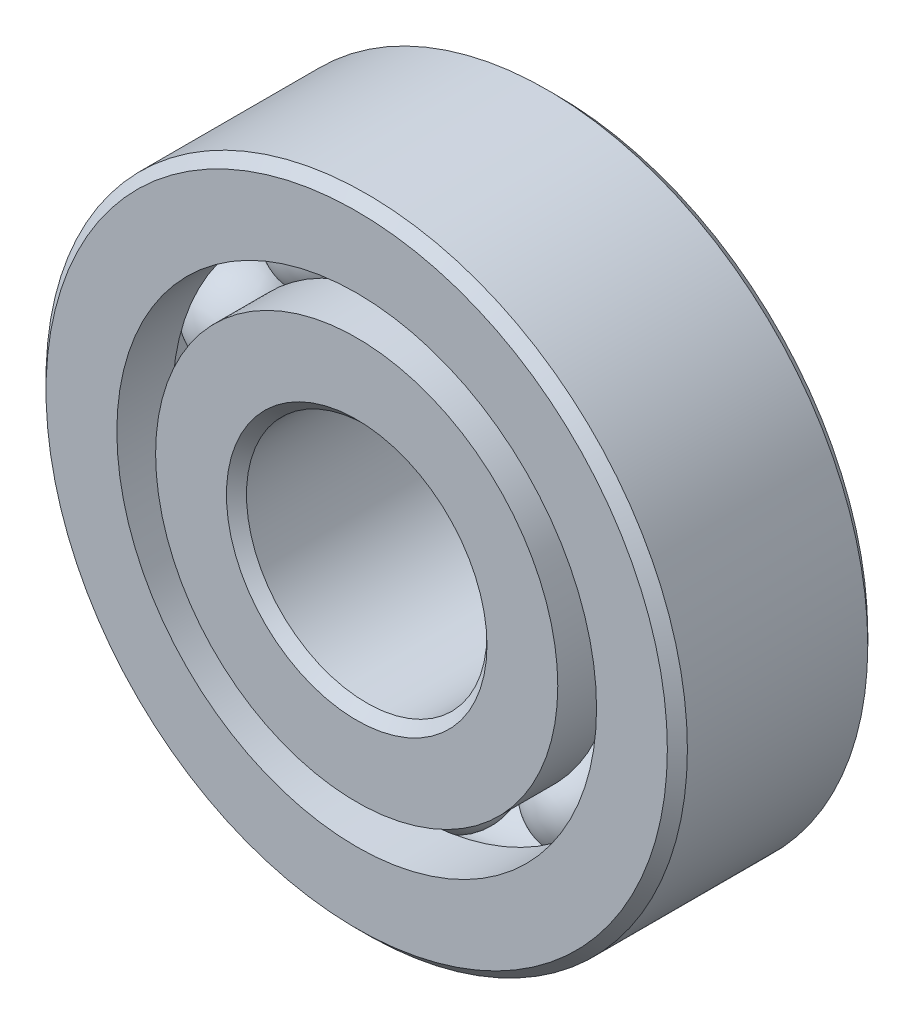
ISO-10303-21;
HEADER;
FILE_DESCRIPTION(('STEP AP214'),'2;1');
FILE_NAME('part.step','',(''),(''),'','','');
FILE_SCHEMA(('AUTOMOTIVE_DESIGN { 1 0 10303 214 1 1 1 1 }'));
ENDSEC;
DATA;
#1=APPLICATION_CONTEXT('core data for automotive mechanical design processes');
#2=APPLICATION_PROTOCOL_DEFINITION('international standard','automotive_design',2000,#1);
#3=PRODUCT_CONTEXT('',#1,'mechanical');
#4=PRODUCT('Part','Part','',(#3));
#5=PRODUCT_RELATED_PRODUCT_CATEGORY('part','',(#4));
#6=PRODUCT_DEFINITION_FORMATION('','',#4);
#7=PRODUCT_DEFINITION_CONTEXT('part definition',#1,'design');
#8=PRODUCT_DEFINITION('design','',#6,#7);
#9=PRODUCT_DEFINITION_SHAPE('','',#8);
#10=(LENGTH_UNIT() NAMED_UNIT(*) SI_UNIT(.MILLI.,.METRE.));
#11=(NAMED_UNIT(*) PLANE_ANGLE_UNIT() SI_UNIT($,.RADIAN.));
#12=(NAMED_UNIT(*) SI_UNIT($,.STERADIAN.) SOLID_ANGLE_UNIT());
#13=UNCERTAINTY_MEASURE_WITH_UNIT(LENGTH_MEASURE(1.E-05),#10,'distance_accuracy_value','');
#14=(GEOMETRIC_REPRESENTATION_CONTEXT(3) GLOBAL_UNCERTAINTY_ASSIGNED_CONTEXT((#13)) GLOBAL_UNIT_ASSIGNED_CONTEXT((#10,
#11,#12)) REPRESENTATION_CONTEXT('',''));
#15=CARTESIAN_POINT('',(0.,0.,0.));
#16=DIRECTION('',(0.,0.,1.));
#17=DIRECTION('',(1.,0.,0.));
#18=AXIS2_PLACEMENT_3D('',#15,#16,#17);
#19=CARTESIAN_POINT('',(-2.56604999203928,3.53186481606816,0.));
#20=DIRECTION('',(0.,0.,1.));
#21=DIRECTION('',(-0.587785252292462,0.809016994374955,0.));
#22=AXIS2_PLACEMENT_3D('',#19,#20,#21);
#23=SPHERICAL_SURFACE('',#22,0.961832467237323);
#24=CARTESIAN_POINT('',(-2.56604999203928,3.53186481606816,0.961832467237323));
#25=VERTEX_POINT('',#24);
#26=VERTEX_LOOP('',#25);
#27=FACE_BOUND('',#26,.T.);
#28=ADVANCED_FACE('F39',(#27),#23,.T.);
#29=CLOSED_SHELL('',(#28));
#30=MANIFOLD_SOLID_BREP('B2',#29);
#31=CARTESIAN_POINT('',(-4.15195610395101,1.34905231606818,0.));
#32=DIRECTION('',(0.,0.,1.));
#33=DIRECTION('',(-0.95105651629515,0.309016994374958,0.));
#34=AXIS2_PLACEMENT_3D('',#31,#32,#33);
#35=SPHERICAL_SURFACE('',#34,0.961832467237323);
#36=CARTESIAN_POINT('',(-4.15195610395101,1.34905231606818,0.961832467237323));
#37=VERTEX_POINT('',#36);
#38=VERTEX_LOOP('',#37);
#39=FACE_BOUND('',#38,.T.);
#40=ADVANCED_FACE('F59',(#39),#35,.T.);
#41=CLOSED_SHELL('',(#40));
#42=MANIFOLD_SOLID_BREP('B6',#41);
#43=CARTESIAN_POINT('',(-4.15195610395104,-1.34905231606809,0.));
#44=DIRECTION('',(0.,0.,1.));
#45=DIRECTION('',(-0.951056516295157,-0.309016994374938,0.));
#46=AXIS2_PLACEMENT_3D('',#43,#44,#45);
#47=SPHERICAL_SURFACE('',#46,0.961832467237323);
#48=CARTESIAN_POINT('',(-4.15195610395104,-1.34905231606809,0.961832467237323));
#49=VERTEX_POINT('',#48);
#50=VERTEX_LOOP('',#49);
#51=FACE_BOUND('',#50,.T.);
#52=ADVANCED_FACE('F79',(#51),#47,.T.);
#53=CLOSED_SHELL('',(#52));
#54=MANIFOLD_SOLID_BREP('B35',#53);
#55=CARTESIAN_POINT('',(-2.56604999203936,-3.53186481606811,0.));
#56=DIRECTION('',(0.,0.,1.));
#57=DIRECTION('',(-0.58778525229248,-0.809016994374942,0.));
#58=AXIS2_PLACEMENT_3D('',#55,#56,#57);
#59=SPHERICAL_SURFACE('',#58,0.961832467237323);
#60=CARTESIAN_POINT('',(-2.56604999203936,-3.53186481606811,0.961832467237323));
#61=VERTEX_POINT('',#60);
#62=VERTEX_LOOP('',#61);
#63=FACE_BOUND('',#62,.T.);
#64=ADVANCED_FACE('F99',(#63),#59,.T.);
#65=CLOSED_SHELL('',(#64));
#66=MANIFOLD_SOLID_BREP('B55',#65);
#67=CARTESIAN_POINT('',(0.,-4.365625,0.));
#68=DIRECTION('',(0.,0.,1.));
#69=DIRECTION('',(0.,-1.,0.));
#70=AXIS2_PLACEMENT_3D('',#67,#68,#69);
#71=SPHERICAL_SURFACE('',#70,0.961832467237323);
#72=CARTESIAN_POINT('',(0.,-4.365625,0.961832467237323));
#73=VERTEX_POINT('',#72);
#74=VERTEX_LOOP('',#73);
#75=FACE_BOUND('',#74,.T.);
#76=ADVANCED_FACE('F119',(#75),#71,.T.);
#77=CLOSED_SHELL('',(#76));
#78=MANIFOLD_SOLID_BREP('B75',#77);
#79=CARTESIAN_POINT('',(2.56604999203931,-3.53186481606814,0.));
#80=DIRECTION('',(0.,0.,1.));
#81=DIRECTION('',(0.587785252292469,-0.809016994374951,0.));
#82=AXIS2_PLACEMENT_3D('',#79,#80,#81);
#83=SPHERICAL_SURFACE('',#82,0.961832467237323);
#84=CARTESIAN_POINT('',(2.56604999203931,-3.53186481606814,0.961832467237323));
#85=VERTEX_POINT('',#84);
#86=VERTEX_LOOP('',#85);
#87=FACE_BOUND('',#86,.T.);
#88=ADVANCED_FACE('F139',(#87),#83,.T.);
#89=CLOSED_SHELL('',(#88));
#90=MANIFOLD_SOLID_BREP('B95',#89);
#91=CARTESIAN_POINT('',(4.15195610395102,-1.34905231606815,0.));
#92=DIRECTION('',(0.,0.,1.));
#93=DIRECTION('',(0.951056516295152,-0.309016994374952,0.));
#94=AXIS2_PLACEMENT_3D('',#91,#92,#93);
#95=SPHERICAL_SURFACE('',#94,0.961832467237323);
#96=CARTESIAN_POINT('',(4.15195610395102,-1.34905231606815,0.961832467237323));
#97=VERTEX_POINT('',#96);
#98=VERTEX_LOOP('',#97);
#99=FACE_BOUND('',#98,.T.);
#100=ADVANCED_FACE('F159',(#99),#95,.T.);
#101=CLOSED_SHELL('',(#100));
#102=MANIFOLD_SOLID_BREP('B115',#101);
#103=CARTESIAN_POINT('',(4.15195610395103,1.34905231606812,0.));
#104=DIRECTION('',(0.,0.,1.));
#105=DIRECTION('',(0.951056516295155,0.309016994374945,0.));
#106=AXIS2_PLACEMENT_3D('',#103,#104,#105);
#107=SPHERICAL_SURFACE('',#106,0.961832467237323);
#108=CARTESIAN_POINT('',(4.15195610395103,1.34905231606812,0.961832467237323));
#109=VERTEX_POINT('',#108);
#110=VERTEX_LOOP('',#109);
#111=FACE_BOUND('',#110,.T.);
#112=ADVANCED_FACE('F179',(#111),#107,.T.);
#113=CLOSED_SHELL('',(#112));
#114=MANIFOLD_SOLID_BREP('B135',#113);
#115=CARTESIAN_POINT('',(2.56604999203933,3.53186481606813,0.));
#116=DIRECTION('',(0.,0.,1.));
#117=DIRECTION('',(0.587785252292474,0.809016994374947,0.));
#118=AXIS2_PLACEMENT_3D('',#115,#116,#117);
#119=SPHERICAL_SURFACE('',#118,0.961832467237323);
#120=CARTESIAN_POINT('',(2.56604999203933,3.53186481606813,0.961832467237323));
#121=VERTEX_POINT('',#120);
#122=VERTEX_LOOP('',#121);
#123=FACE_BOUND('',#122,.T.);
#124=ADVANCED_FACE('F199',(#123),#119,.T.);
#125=CLOSED_SHELL('',(#124));
#126=MANIFOLD_SOLID_BREP('B155',#125);
#127=CARTESIAN_POINT('',(0.,4.365625,0.));
#128=DIRECTION('',(0.,0.,1.));
#129=DIRECTION('',(0.,1.,0.));
#130=AXIS2_PLACEMENT_3D('',#127,#128,#129);
#131=SPHERICAL_SURFACE('',#130,0.961832467237323);
#132=CARTESIAN_POINT('',(0.,4.365625,0.961832467237323));
#133=VERTEX_POINT('',#132);
#134=VERTEX_LOOP('',#133);
#135=FACE_BOUND('',#134,.T.);
#136=ADVANCED_FACE('F221',(#135),#131,.T.);
#137=CLOSED_SHELL('',(#136));
#138=MANIFOLD_SOLID_BREP('B175',#137);
#139=CARTESIAN_POINT('',(0.,3.98183379120879,1.984375));
#140=DIRECTION('',(0.,0.,-1.));
#141=DIRECTION('',(-1.,0.,0.));
#142=AXIS2_PLACEMENT_3D('',#139,#140,#141);
#143=PLANE('',#142);
#144=CARTESIAN_POINT('',(0.,0.,1.984375));
#145=DIRECTION('',(0.,0.,1.));
#146=DIRECTION('',(1.,0.,0.));
#147=AXIS2_PLACEMENT_3D('',#144,#145,#146);
#148=CIRCLE('',#147,2.5796875);
#149=CARTESIAN_POINT('',(2.5796875,0.,1.984375));
#150=VERTEX_POINT('',#149);
#151=EDGE_CURVE('E268',#150,#150,#148,.T.);
#152=ORIENTED_EDGE('',*,*,#151,.F.);
#153=EDGE_LOOP('',(#152));
#154=FACE_BOUND('',#153,.T.);
#155=CARTESIAN_POINT('',(0.,0.,1.984375));
#156=DIRECTION('',(0.,0.,1.));
#157=DIRECTION('',(1.,0.,0.));
#158=AXIS2_PLACEMENT_3D('',#155,#156,#157);
#159=CIRCLE('',#158,3.98183379120879);
#160=CARTESIAN_POINT('',(3.98183379120879,0.,1.984375));
#161=VERTEX_POINT('',#160);
#162=EDGE_CURVE('E220',#161,#161,#159,.T.);
#163=ORIENTED_EDGE('',*,*,#162,.T.);
#164=EDGE_LOOP('',(#163));
#165=FACE_BOUND('',#164,.T.);
#166=ADVANCED_FACE('F240',(#154,#165),#143,.F.);
#167=CARTESIAN_POINT('',(0.,0.,1.984375));
#168=DIRECTION('',(0.,0.,1.));
#169=DIRECTION('',(1.,0.,0.));
#170=AXIS2_PLACEMENT_3D('',#167,#168,#169);
#171=CYLINDRICAL_SURFACE('',#170,3.98183379120879);
#172=ORIENTED_EDGE('',*,*,#162,.F.);
#173=EDGE_LOOP('',(#172));
#174=FACE_BOUND('',#173,.T.);
#175=CARTESIAN_POINT('',(0.,0.,0.881944444444444));
#176=DIRECTION('',(0.,0.,1.));
#177=DIRECTION('',(1.,0.,0.));
#178=AXIS2_PLACEMENT_3D('',#175,#176,#177);
#179=CIRCLE('',#178,3.98183379120879);
#180=CARTESIAN_POINT('',(3.98183379120879,0.,0.881944444444444));
#181=VERTEX_POINT('',#180);
#182=EDGE_CURVE('E246',#181,#181,#179,.T.);
#183=ORIENTED_EDGE('',*,*,#182,.T.);
#184=EDGE_LOOP('',(#183));
#185=FACE_BOUND('',#184,.T.);
#186=ADVANCED_FACE('F275',(#174,#185),#171,.T.);
#187=CARTESIAN_POINT('',(0.,0.,0.));
#188=DIRECTION('',(0.,0.,1.));
#189=DIRECTION('',(1.,0.,0.));
#190=AXIS2_PLACEMENT_3D('',#187,#188,#189);
#191=TOROIDAL_SURFACE('',#190,4.365625,0.961832467237321);
#192=ORIENTED_EDGE('',*,*,#182,.F.);
#193=EDGE_LOOP('',(#192));
#194=FACE_BOUND('',#193,.T.);
#195=CARTESIAN_POINT('',(0.,0.,-0.881944444444446));
#196=DIRECTION('',(0.,0.,1.));
#197=DIRECTION('',(1.,0.,0.));
#198=AXIS2_PLACEMENT_3D('',#195,#196,#197);
#199=CIRCLE('',#198,3.98183379120879);
#200=CARTESIAN_POINT('',(3.98183379120879,0.,-0.881944444444446));
#201=VERTEX_POINT('',#200);
#202=EDGE_CURVE('E250',#201,#201,#199,.T.);
#203=ORIENTED_EDGE('',*,*,#202,.T.);
#204=EDGE_LOOP('',(#203));
#205=FACE_BOUND('',#204,.T.);
#206=ADVANCED_FACE('F279',(#194,#205),#191,.F.);
#207=CARTESIAN_POINT('',(0.,0.,1.984375));
#208=DIRECTION('',(0.,0.,1.));
#209=DIRECTION('',(1.,0.,0.));
#210=AXIS2_PLACEMENT_3D('',#207,#208,#209);
#211=CYLINDRICAL_SURFACE('',#210,3.98183379120879);
#212=ORIENTED_EDGE('',*,*,#202,.F.);
#213=EDGE_LOOP('',(#212));
#214=FACE_BOUND('',#213,.T.);
#215=CARTESIAN_POINT('',(0.,0.,-1.984375));
#216=DIRECTION('',(0.,0.,1.));
#217=DIRECTION('',(1.,0.,0.));
#218=AXIS2_PLACEMENT_3D('',#215,#216,#217);
#219=CIRCLE('',#218,3.98183379120879);
#220=CARTESIAN_POINT('',(3.98183379120879,0.,-1.984375));
#221=VERTEX_POINT('',#220);
#222=EDGE_CURVE('E254',#221,#221,#219,.T.);
#223=ORIENTED_EDGE('',*,*,#222,.T.);
#224=EDGE_LOOP('',(#223));
#225=FACE_BOUND('',#224,.T.);
#226=ADVANCED_FACE('F284',(#214,#225),#211,.T.);
#227=CARTESIAN_POINT('',(0.,2.5796875,-1.984375));
#228=DIRECTION('',(0.,0.,1.));
#229=DIRECTION('',(1.,0.,0.));
#230=AXIS2_PLACEMENT_3D('',#227,#228,#229);
#231=PLANE('',#230);
#232=ORIENTED_EDGE('',*,*,#222,.F.);
#233=EDGE_LOOP('',(#232));
#234=FACE_BOUND('',#233,.T.);
#235=CARTESIAN_POINT('',(0.,0.,-1.984375));
#236=DIRECTION('',(0.,0.,1.));
#237=DIRECTION('',(1.,0.,0.));
#238=AXIS2_PLACEMENT_3D('',#235,#236,#237);
#239=CIRCLE('',#238,2.5796875);
#240=CARTESIAN_POINT('',(2.5796875,0.,-1.984375));
#241=VERTEX_POINT('',#240);
#242=EDGE_CURVE('E259',#241,#241,#239,.T.);
#243=ORIENTED_EDGE('',*,*,#242,.T.);
#244=EDGE_LOOP('',(#243));
#245=FACE_BOUND('',#244,.T.);
#246=ADVANCED_FACE('F290',(#234,#245),#231,.F.);
#247=CARTESIAN_POINT('',(0.,0.,-1.7859375));
#248=DIRECTION('',(0.,0.,-1.));
#249=DIRECTION('',(-1.,0.,0.));
#250=AXIS2_PLACEMENT_3D('',#247,#248,#249);
#251=CONICAL_SURFACE('',#250,2.38125,0.785398163397443);
#252=ORIENTED_EDGE('',*,*,#242,.F.);
#253=EDGE_LOOP('',(#252));
#254=FACE_BOUND('',#253,.T.);
#255=CARTESIAN_POINT('',(0.,0.,-1.7859375));
#256=DIRECTION('',(0.,0.,1.));
#257=DIRECTION('',(1.,0.,0.));
#258=AXIS2_PLACEMENT_3D('',#255,#256,#257);
#259=CIRCLE('',#258,2.38125);
#260=CARTESIAN_POINT('',(2.38125,0.,-1.7859375));
#261=VERTEX_POINT('',#260);
#262=EDGE_CURVE('E262',#261,#261,#259,.T.);
#263=ORIENTED_EDGE('',*,*,#262,.T.);
#264=EDGE_LOOP('',(#263));
#265=FACE_BOUND('',#264,.T.);
#266=ADVANCED_FACE('F294',(#254,#265),#251,.F.);
#267=CARTESIAN_POINT('',(0.,0.,1.984375));
#268=DIRECTION('',(0.,0.,1.));
#269=DIRECTION('',(1.,0.,0.));
#270=AXIS2_PLACEMENT_3D('',#267,#268,#269);
#271=CYLINDRICAL_SURFACE('',#270,2.38125);
#272=ORIENTED_EDGE('',*,*,#262,.F.);
#273=EDGE_LOOP('',(#272));
#274=FACE_BOUND('',#273,.T.);
#275=CARTESIAN_POINT('',(0.,0.,1.7859375));
#276=DIRECTION('',(0.,0.,1.));
#277=DIRECTION('',(1.,0.,0.));
#278=AXIS2_PLACEMENT_3D('',#275,#276,#277);
#279=CIRCLE('',#278,2.38125);
#280=CARTESIAN_POINT('',(2.38125,0.,1.7859375));
#281=VERTEX_POINT('',#280);
#282=EDGE_CURVE('E265',#281,#281,#279,.T.);
#283=ORIENTED_EDGE('',*,*,#282,.T.);
#284=EDGE_LOOP('',(#283));
#285=FACE_BOUND('',#284,.T.);
#286=ADVANCED_FACE('F298',(#274,#285),#271,.F.);
#287=CARTESIAN_POINT('',(0.,0.,1.984375));
#288=DIRECTION('',(0.,0.,1.));
#289=DIRECTION('',(1.,0.,0.));
#290=AXIS2_PLACEMENT_3D('',#287,#288,#289);
#291=CONICAL_SURFACE('',#290,2.5796875,0.785398163397453);
#292=ORIENTED_EDGE('',*,*,#282,.F.);
#293=EDGE_LOOP('',(#292));
#294=FACE_BOUND('',#293,.T.);
#295=ORIENTED_EDGE('',*,*,#151,.T.);
#296=EDGE_LOOP('',(#295));
#297=FACE_BOUND('',#296,.T.);
#298=ADVANCED_FACE('F272',(#294,#297),#291,.F.);
#299=CLOSED_SHELL('',(#166,#186,#206,#226,#246,#266,#286,#298));
#300=MANIFOLD_SOLID_BREP('B195',#299);
#301=CARTESIAN_POINT('',(0.,0.,1.7859375));
#302=DIRECTION('',(0.,0.,-1.));
#303=DIRECTION('',(-1.,0.,0.));
#304=AXIS2_PLACEMENT_3D('',#301,#302,#303);
#305=CONICAL_SURFACE('',#304,6.35,0.785398163397447);
#306=CARTESIAN_POINT('',(0.,0.,1.984375));
#307=DIRECTION('',(0.,0.,1.));
#308=DIRECTION('',(1.,0.,0.));
#309=AXIS2_PLACEMENT_3D('',#306,#307,#308);
#310=CIRCLE('',#309,6.1515625);
#311=CARTESIAN_POINT('',(6.1515625,0.,1.984375));
#312=VERTEX_POINT('',#311);
#313=EDGE_CURVE('E389',#312,#312,#310,.T.);
#314=ORIENTED_EDGE('',*,*,#313,.F.);
#315=EDGE_LOOP('',(#314));
#316=FACE_BOUND('',#315,.T.);
#317=CARTESIAN_POINT('',(0.,0.,1.7859375));
#318=DIRECTION('',(0.,0.,1.));
#319=DIRECTION('',(1.,0.,0.));
#320=AXIS2_PLACEMENT_3D('',#317,#318,#319);
#321=CIRCLE('',#320,6.35);
#322=CARTESIAN_POINT('',(6.35,0.,1.7859375));
#323=VERTEX_POINT('',#322);
#324=EDGE_CURVE('E239',#323,#323,#321,.T.);
#325=ORIENTED_EDGE('',*,*,#324,.T.);
#326=EDGE_LOOP('',(#325));
#327=FACE_BOUND('',#326,.T.);
#328=ADVANCED_FACE('F361',(#316,#327),#305,.T.);
#329=CARTESIAN_POINT('',(0.,0.,1.984375));
#330=DIRECTION('',(0.,0.,1.));
#331=DIRECTION('',(1.,0.,0.));
#332=AXIS2_PLACEMENT_3D('',#329,#330,#331);
#333=CYLINDRICAL_SURFACE('',#332,6.35);
#334=ORIENTED_EDGE('',*,*,#324,.F.);
#335=EDGE_LOOP('',(#334));
#336=FACE_BOUND('',#335,.T.);
#337=CARTESIAN_POINT('',(0.,0.,-1.7859375));
#338=DIRECTION('',(0.,0.,1.));
#339=DIRECTION('',(1.,0.,0.));
#340=AXIS2_PLACEMENT_3D('',#337,#338,#339);
#341=CIRCLE('',#340,6.35);
#342=CARTESIAN_POINT('',(6.35,0.,-1.7859375));
#343=VERTEX_POINT('',#342);
#344=EDGE_CURVE('E367',#343,#343,#341,.T.);
#345=ORIENTED_EDGE('',*,*,#344,.T.);
#346=EDGE_LOOP('',(#345));
#347=FACE_BOUND('',#346,.T.);
#348=ADVANCED_FACE('F396',(#336,#347),#333,.T.);
#349=CARTESIAN_POINT('',(0.,0.,-1.984375));
#350=DIRECTION('',(0.,0.,1.));
#351=DIRECTION('',(1.,0.,0.));
#352=AXIS2_PLACEMENT_3D('',#349,#350,#351);
#353=CONICAL_SURFACE('',#352,6.1515625,0.785398163397446);
#354=ORIENTED_EDGE('',*,*,#344,.F.);
#355=EDGE_LOOP('',(#354));
#356=FACE_BOUND('',#355,.T.);
#357=CARTESIAN_POINT('',(0.,0.,-1.984375));
#358=DIRECTION('',(0.,0.,1.));
#359=DIRECTION('',(1.,0.,0.));
#360=AXIS2_PLACEMENT_3D('',#357,#358,#359);
#361=CIRCLE('',#360,6.1515625);
#362=CARTESIAN_POINT('',(6.1515625,0.,-1.984375));
#363=VERTEX_POINT('',#362);
#364=EDGE_CURVE('E371',#363,#363,#361,.T.);
#365=ORIENTED_EDGE('',*,*,#364,.T.);
#366=EDGE_LOOP('',(#365));
#367=FACE_BOUND('',#366,.T.);
#368=ADVANCED_FACE('F400',(#356,#367),#353,.T.);
#369=CARTESIAN_POINT('',(0.,6.1515625,-1.984375));
#370=DIRECTION('',(0.,0.,1.));
#371=DIRECTION('',(1.,0.,0.));
#372=AXIS2_PLACEMENT_3D('',#369,#370,#371);
#373=PLANE('',#372);
#374=ORIENTED_EDGE('',*,*,#364,.F.);
#375=EDGE_LOOP('',(#374));
#376=FACE_BOUND('',#375,.T.);
#377=CARTESIAN_POINT('',(0.,0.,-1.984375));
#378=DIRECTION('',(0.,0.,1.));
#379=DIRECTION('',(1.,0.,0.));
#380=AXIS2_PLACEMENT_3D('',#377,#378,#379);
#381=CIRCLE('',#380,4.74941620879121);
#382=CARTESIAN_POINT('',(4.74941620879121,0.,-1.984375));
#383=VERTEX_POINT('',#382);
#384=EDGE_CURVE('E375',#383,#383,#381,.T.);
#385=ORIENTED_EDGE('',*,*,#384,.T.);
#386=EDGE_LOOP('',(#385));
#387=FACE_BOUND('',#386,.T.);
#388=ADVANCED_FACE('F405',(#376,#387),#373,.F.);
#389=CARTESIAN_POINT('',(0.,0.,1.984375));
#390=DIRECTION('',(0.,0.,1.));
#391=DIRECTION('',(1.,0.,0.));
#392=AXIS2_PLACEMENT_3D('',#389,#390,#391);
#393=CYLINDRICAL_SURFACE('',#392,4.74941620879121);
#394=ORIENTED_EDGE('',*,*,#384,.F.);
#395=EDGE_LOOP('',(#394));
#396=FACE_BOUND('',#395,.T.);
#397=CARTESIAN_POINT('',(0.,0.,-0.881944444444445));
#398=DIRECTION('',(0.,0.,1.));
#399=DIRECTION('',(1.,0.,0.));
#400=AXIS2_PLACEMENT_3D('',#397,#398,#399);
#401=CIRCLE('',#400,4.74941620879121);
#402=CARTESIAN_POINT('',(4.74941620879121,0.,-0.881944444444445));
#403=VERTEX_POINT('',#402);
#404=EDGE_CURVE('E380',#403,#403,#401,.T.);
#405=ORIENTED_EDGE('',*,*,#404,.T.);
#406=EDGE_LOOP('',(#405));
#407=FACE_BOUND('',#406,.T.);
#408=ADVANCED_FACE('F411',(#396,#407),#393,.F.);
#409=CARTESIAN_POINT('',(0.,0.,0.));
#410=DIRECTION('',(0.,0.,1.));
#411=DIRECTION('',(1.,0.,0.));
#412=AXIS2_PLACEMENT_3D('',#409,#410,#411);
#413=TOROIDAL_SURFACE('',#412,4.365625,0.961832467237323);
#414=ORIENTED_EDGE('',*,*,#404,.F.);
#415=EDGE_LOOP('',(#414));
#416=FACE_BOUND('',#415,.T.);
#417=CARTESIAN_POINT('',(0.,0.,0.881944444444444));
#418=DIRECTION('',(0.,0.,1.));
#419=DIRECTION('',(1.,0.,0.));
#420=AXIS2_PLACEMENT_3D('',#417,#418,#419);
#421=CIRCLE('',#420,4.74941620879121);
#422=CARTESIAN_POINT('',(4.74941620879121,0.,0.881944444444444));
#423=VERTEX_POINT('',#422);
#424=EDGE_CURVE('E383',#423,#423,#421,.T.);
#425=ORIENTED_EDGE('',*,*,#424,.T.);
#426=EDGE_LOOP('',(#425));
#427=FACE_BOUND('',#426,.T.);
#428=ADVANCED_FACE('F415',(#416,#427),#413,.F.);
#429=CARTESIAN_POINT('',(0.,0.,1.984375));
#430=DIRECTION('',(0.,0.,1.));
#431=DIRECTION('',(1.,0.,0.));
#432=AXIS2_PLACEMENT_3D('',#429,#430,#431);
#433=CYLINDRICAL_SURFACE('',#432,4.74941620879121);
#434=ORIENTED_EDGE('',*,*,#424,.F.);
#435=EDGE_LOOP('',(#434));
#436=FACE_BOUND('',#435,.T.);
#437=CARTESIAN_POINT('',(0.,0.,1.984375));
#438=DIRECTION('',(0.,0.,1.));
#439=DIRECTION('',(1.,0.,0.));
#440=AXIS2_PLACEMENT_3D('',#437,#438,#439);
#441=CIRCLE('',#440,4.74941620879121);
#442=CARTESIAN_POINT('',(4.74941620879121,0.,1.984375));
#443=VERTEX_POINT('',#442);
#444=EDGE_CURVE('E386',#443,#443,#441,.T.);
#445=ORIENTED_EDGE('',*,*,#444,.T.);
#446=EDGE_LOOP('',(#445));
#447=FACE_BOUND('',#446,.T.);
#448=ADVANCED_FACE('F419',(#436,#447),#433,.F.);
#449=CARTESIAN_POINT('',(0.,6.1515625,1.984375));
#450=DIRECTION('',(0.,0.,-1.));
#451=DIRECTION('',(-1.,0.,0.));
#452=AXIS2_PLACEMENT_3D('',#449,#450,#451);
#453=PLANE('',#452);
#454=ORIENTED_EDGE('',*,*,#444,.F.);
#455=EDGE_LOOP('',(#454));
#456=FACE_BOUND('',#455,.T.);
#457=ORIENTED_EDGE('',*,*,#313,.T.);
#458=EDGE_LOOP('',(#457));
#459=FACE_BOUND('',#458,.T.);
#460=ADVANCED_FACE('F393',(#456,#459),#453,.F.);
#461=CLOSED_SHELL('',(#328,#348,#368,#388,#408,#428,#448,#460));
#462=MANIFOLD_SOLID_BREP('B215',#461);
#463=ADVANCED_BREP_SHAPE_REPRESENTATION('',(#18,#30,#42,#54,#66,#78,#90,#102,#114,#126,#138,
#300,#462),#14);
#464=SHAPE_DEFINITION_REPRESENTATION(#9,#463);
ENDSEC;
END-ISO-10303-21;
